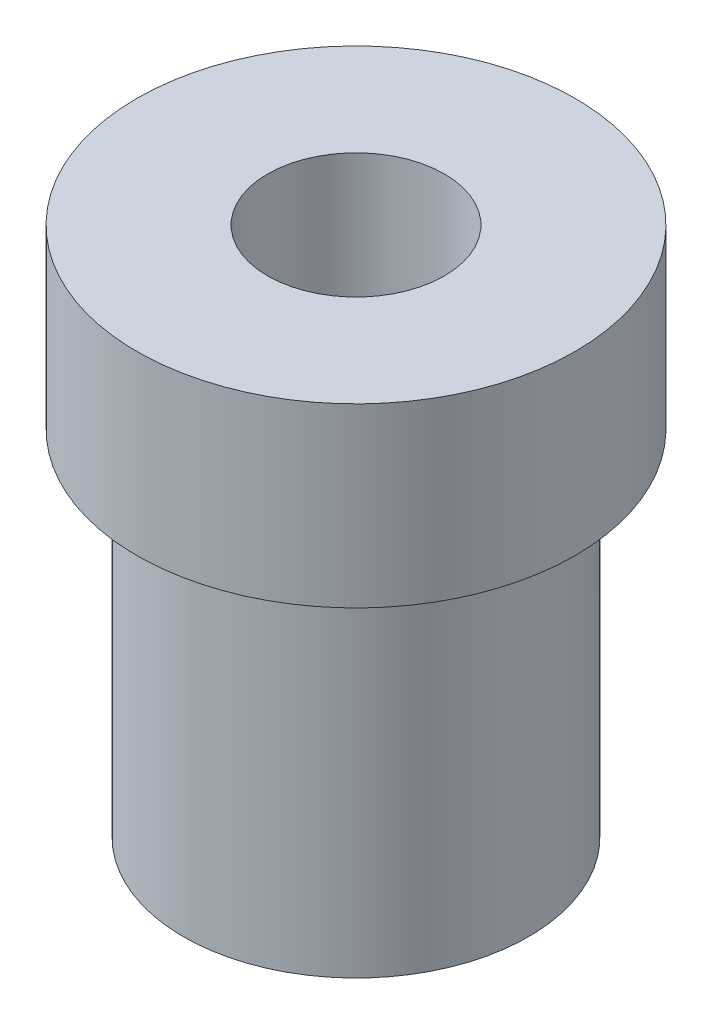
ISO-10303-21;
HEADER;
FILE_DESCRIPTION(('STEP AP214'),'2;1');
FILE_NAME('part.step','',(''),(''),'','','');
FILE_SCHEMA(('AUTOMOTIVE_DESIGN { 1 0 10303 214 1 1 1 1 }'));
ENDSEC;
DATA;
#1=APPLICATION_CONTEXT('core data for automotive mechanical design processes');
#2=APPLICATION_PROTOCOL_DEFINITION('international standard','automotive_design',2000,#1);
#3=PRODUCT_CONTEXT('',#1,'mechanical');
#4=PRODUCT('Part','Part','',(#3));
#5=PRODUCT_RELATED_PRODUCT_CATEGORY('part','',(#4));
#6=PRODUCT_DEFINITION_FORMATION('','',#4);
#7=PRODUCT_DEFINITION_CONTEXT('part definition',#1,'design');
#8=PRODUCT_DEFINITION('design','',#6,#7);
#9=PRODUCT_DEFINITION_SHAPE('','',#8);
#10=(LENGTH_UNIT() NAMED_UNIT(*) SI_UNIT(.MILLI.,.METRE.));
#11=(NAMED_UNIT(*) PLANE_ANGLE_UNIT() SI_UNIT($,.RADIAN.));
#12=(NAMED_UNIT(*) SI_UNIT($,.STERADIAN.) SOLID_ANGLE_UNIT());
#13=UNCERTAINTY_MEASURE_WITH_UNIT(LENGTH_MEASURE(1.E-05),#10,'distance_accuracy_value','');
#14=(GEOMETRIC_REPRESENTATION_CONTEXT(3) GLOBAL_UNCERTAINTY_ASSIGNED_CONTEXT((#13)) GLOBAL_UNIT_ASSIGNED_CONTEXT((#10,
#11,#12)) REPRESENTATION_CONTEXT('',''));
#15=CARTESIAN_POINT('',(0.,0.,0.));
#16=DIRECTION('',(0.,0.,1.));
#17=DIRECTION('',(1.,0.,0.));
#18=AXIS2_PLACEMENT_3D('',#15,#16,#17);
#19=CARTESIAN_POINT('',(3.09880000000133,0.,0.));
#20=DIRECTION('',(0.,1.,0.));
#21=DIRECTION('',(-1.,0.,0.));
#22=AXIS2_PLACEMENT_3D('',#19,#20,#21);
#23=PLANE('',#22);
#24=CARTESIAN_POINT('',(0.,0.,0.));
#25=DIRECTION('',(0.,1.,0.));
#26=DIRECTION('',(-1.,0.,0.));
#27=AXIS2_PLACEMENT_3D('',#24,#25,#26);
#28=CIRCLE('',#27,3.09880000000133);
#29=CARTESIAN_POINT('',(-3.09880000000133,0.,0.));
#30=VERTEX_POINT('',#29);
#31=EDGE_CURVE('E68',#30,#30,#28,.T.);
#32=ORIENTED_EDGE('',*,*,#31,.F.);
#33=EDGE_LOOP('',(#32));
#34=FACE_BOUND('',#33,.T.);
#35=CARTESIAN_POINT('',(0.,0.,0.));
#36=DIRECTION('',(0.,1.,0.));
#37=DIRECTION('',(-1.,0.,0.));
#38=AXIS2_PLACEMENT_3D('',#35,#36,#37);
#39=CIRCLE('',#38,1.5875);
#40=CARTESIAN_POINT('',(-1.5875,0.,0.));
#41=VERTEX_POINT('',#40);
#42=EDGE_CURVE('E10',#41,#41,#39,.T.);
#43=ORIENTED_EDGE('',*,*,#42,.T.);
#44=EDGE_LOOP('',(#43));
#45=FACE_BOUND('',#44,.T.);
#46=ADVANCED_FACE('F41',(#34,#45),#23,.F.);
#47=CARTESIAN_POINT('',(0.,0.120875177305015,0.));
#48=DIRECTION('',(0.,1.,0.));
#49=DIRECTION('',(-1.,0.,0.));
#50=AXIS2_PLACEMENT_3D('',#47,#48,#49);
#51=CYLINDRICAL_SURFACE('',#50,1.5875);
#52=ORIENTED_EDGE('',*,*,#42,.F.);
#53=EDGE_LOOP('',(#52));
#54=FACE_BOUND('',#53,.T.);
#55=CARTESIAN_POINT('',(0.,9.525,0.));
#56=DIRECTION('',(0.,1.,0.));
#57=DIRECTION('',(-1.,0.,0.));
#58=AXIS2_PLACEMENT_3D('',#55,#56,#57);
#59=CIRCLE('',#58,1.5875);
#60=CARTESIAN_POINT('',(-1.5875,9.525,0.));
#61=VERTEX_POINT('',#60);
#62=EDGE_CURVE('E48',#61,#61,#59,.T.);
#63=ORIENTED_EDGE('',*,*,#62,.T.);
#64=EDGE_LOOP('',(#63));
#65=FACE_BOUND('',#64,.T.);
#66=ADVANCED_FACE('F76',(#54,#65),#51,.F.);
#67=CARTESIAN_POINT('',(1.5875,9.525,0.));
#68=DIRECTION('',(0.,-1.,0.));
#69=DIRECTION('',(1.,0.,0.));
#70=AXIS2_PLACEMENT_3D('',#67,#68,#69);
#71=PLANE('',#70);
#72=ORIENTED_EDGE('',*,*,#62,.F.);
#73=EDGE_LOOP('',(#72));
#74=FACE_BOUND('',#73,.T.);
#75=CARTESIAN_POINT('',(0.,9.525,0.));
#76=DIRECTION('',(0.,1.,0.));
#77=DIRECTION('',(-1.,0.,0.));
#78=AXIS2_PLACEMENT_3D('',#75,#76,#77);
#79=CIRCLE('',#78,3.937);
#80=CARTESIAN_POINT('',(-3.937,9.525,0.));
#81=VERTEX_POINT('',#80);
#82=EDGE_CURVE('E53',#81,#81,#79,.T.);
#83=ORIENTED_EDGE('',*,*,#82,.T.);
#84=EDGE_LOOP('',(#83));
#85=FACE_BOUND('',#84,.T.);
#86=ADVANCED_FACE('F80',(#74,#85),#71,.F.);
#87=CARTESIAN_POINT('',(0.,0.120875177305015,0.));
#88=DIRECTION('',(0.,1.,0.));
#89=DIRECTION('',(-1.,0.,0.));
#90=AXIS2_PLACEMENT_3D('',#87,#88,#89);
#91=CYLINDRICAL_SURFACE('',#90,3.937);
#92=ORIENTED_EDGE('',*,*,#82,.F.);
#93=EDGE_LOOP('',(#92));
#94=FACE_BOUND('',#93,.T.);
#95=CARTESIAN_POINT('',(0.,6.35,0.));
#96=DIRECTION('',(0.,1.,0.));
#97=DIRECTION('',(-1.,0.,0.));
#98=AXIS2_PLACEMENT_3D('',#95,#96,#97);
#99=CIRCLE('',#98,3.937);
#100=CARTESIAN_POINT('',(-3.937,6.35,0.));
#101=VERTEX_POINT('',#100);
#102=EDGE_CURVE('E58',#101,#101,#99,.T.);
#103=ORIENTED_EDGE('',*,*,#102,.T.);
#104=EDGE_LOOP('',(#103));
#105=FACE_BOUND('',#104,.T.);
#106=ADVANCED_FACE('F85',(#94,#105),#91,.T.);
#107=CARTESIAN_POINT('',(3.937,6.35,0.));
#108=DIRECTION('',(0.,1.,0.));
#109=DIRECTION('',(-1.,0.,0.));
#110=AXIS2_PLACEMENT_3D('',#107,#108,#109);
#111=PLANE('',#110);
#112=ORIENTED_EDGE('',*,*,#102,.F.);
#113=EDGE_LOOP('',(#112));
#114=FACE_BOUND('',#113,.T.);
#115=CARTESIAN_POINT('',(0.,6.35,0.));
#116=DIRECTION('',(0.,1.,0.));
#117=DIRECTION('',(-1.,0.,0.));
#118=AXIS2_PLACEMENT_3D('',#115,#116,#117);
#119=CIRCLE('',#118,3.0988);
#120=CARTESIAN_POINT('',(-3.0988,6.35,0.));
#121=VERTEX_POINT('',#120);
#122=EDGE_CURVE('E64',#121,#121,#119,.T.);
#123=ORIENTED_EDGE('',*,*,#122,.T.);
#124=EDGE_LOOP('',(#123));
#125=FACE_BOUND('',#124,.T.);
#126=ADVANCED_FACE('F91',(#114,#125),#111,.F.);
#127=CARTESIAN_POINT('',(0.,0.120875177305015,0.));
#128=DIRECTION('',(0.,1.,0.));
#129=DIRECTION('',(-1.,0.,0.));
#130=AXIS2_PLACEMENT_3D('',#127,#128,#129);
#131=CYLINDRICAL_SURFACE('',#130,3.09880000000067);
#132=ORIENTED_EDGE('',*,*,#122,.F.);
#133=EDGE_LOOP('',(#132));
#134=FACE_BOUND('',#133,.T.);
#135=ORIENTED_EDGE('',*,*,#31,.T.);
#136=EDGE_LOOP('',(#135));
#137=FACE_BOUND('',#136,.T.);
#138=ADVANCED_FACE('F73',(#134,#137),#131,.T.);
#139=CLOSED_SHELL('',(#46,#66,#86,#106,#126,#138));
#140=MANIFOLD_SOLID_BREP('B2',#139);
#141=ADVANCED_BREP_SHAPE_REPRESENTATION('',(#18,#140),#14);
#142=SHAPE_DEFINITION_REPRESENTATION(#9,#141);
ENDSEC;
END-ISO-10303-21;
